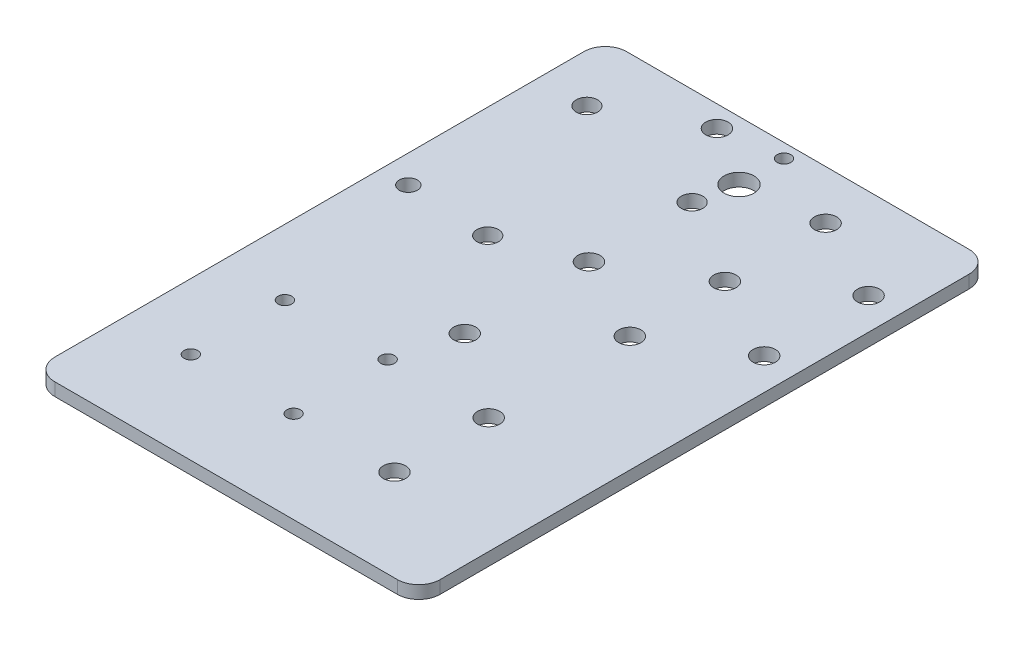
ISO-10303-21;
HEADER;
FILE_DESCRIPTION(('STEP AP214'),'2;1');
FILE_NAME('part.step','',(''),(''),'','','');
FILE_SCHEMA(('AUTOMOTIVE_DESIGN { 1 0 10303 214 1 1 1 1 }'));
ENDSEC;
DATA;
#1=APPLICATION_CONTEXT('core data for automotive mechanical design processes');
#2=APPLICATION_PROTOCOL_DEFINITION('international standard','automotive_design',2000,#1);
#3=PRODUCT_CONTEXT('',#1,'mechanical');
#4=PRODUCT('Part','Part','',(#3));
#5=PRODUCT_RELATED_PRODUCT_CATEGORY('part','',(#4));
#6=PRODUCT_DEFINITION_FORMATION('','',#4);
#7=PRODUCT_DEFINITION_CONTEXT('part definition',#1,'design');
#8=PRODUCT_DEFINITION('design','',#6,#7);
#9=PRODUCT_DEFINITION_SHAPE('','',#8);
#10=(LENGTH_UNIT() NAMED_UNIT(*) SI_UNIT(.MILLI.,.METRE.));
#11=(NAMED_UNIT(*) PLANE_ANGLE_UNIT() SI_UNIT($,.RADIAN.));
#12=(NAMED_UNIT(*) SI_UNIT($,.STERADIAN.) SOLID_ANGLE_UNIT());
#13=UNCERTAINTY_MEASURE_WITH_UNIT(LENGTH_MEASURE(1.E-05),#10,'distance_accuracy_value','');
#14=(GEOMETRIC_REPRESENTATION_CONTEXT(3) GLOBAL_UNCERTAINTY_ASSIGNED_CONTEXT((#13)) GLOBAL_UNIT_ASSIGNED_CONTEXT((#10,
#11,#12)) REPRESENTATION_CONTEXT('',''));
#15=CARTESIAN_POINT('',(0.,0.,0.));
#16=DIRECTION('',(0.,0.,1.));
#17=DIRECTION('',(1.,0.,0.));
#18=AXIS2_PLACEMENT_3D('',#15,#16,#17);
#19=CARTESIAN_POINT('',(0.,3.,0.));
#20=DIRECTION('',(0.,-1.,0.));
#21=DIRECTION('',(0.,0.,-1.));
#22=AXIS2_PLACEMENT_3D('',#19,#20,#21);
#23=PLANE('',#22);
#24=CARTESIAN_POINT('',(-3.55876124588053,3.,77.1695048170981));
#25=DIRECTION('',(0.,1.,0.));
#26=DIRECTION('',(0.,0.,1.));
#27=AXIS2_PLACEMENT_3D('',#24,#25,#26);
#28=CIRCLE('',#27,2.6);
#29=CARTESIAN_POINT('',(-3.55876124588053,3.,79.7695048170981));
#30=VERTEX_POINT('',#29);
#31=EDGE_CURVE('E533',#30,#30,#28,.T.);
#32=ORIENTED_EDGE('',*,*,#31,.F.);
#33=EDGE_LOOP('',(#32));
#34=FACE_BOUND('',#33,.T.);
#35=CARTESIAN_POINT('',(-23.3936515938965,3.,11.9198305394652));
#36=DIRECTION('',(0.,1.,0.));
#37=DIRECTION('',(0.,0.,1.));
#38=AXIS2_PLACEMENT_3D('',#35,#36,#37);
#39=CIRCLE('',#38,2.6);
#40=CARTESIAN_POINT('',(-23.3936515938965,3.,14.5198305394652));
#41=VERTEX_POINT('',#40);
#42=EDGE_CURVE('E535',#41,#41,#39,.T.);
#43=ORIENTED_EDGE('',*,*,#42,.F.);
#44=EDGE_LOOP('',(#43));
#45=FACE_BOUND('',#44,.T.);
#46=CARTESIAN_POINT('',(-27.1536514563145,3.,55.1695048170967));
#47=DIRECTION('',(0.,1.,0.));
#48=DIRECTION('',(0.,0.,1.));
#49=AXIS2_PLACEMENT_3D('',#46,#47,#48);
#50=CIRCLE('',#49,1.60000000000001);
#51=CARTESIAN_POINT('',(-27.1536514563145,3.,56.7695048170967));
#52=VERTEX_POINT('',#51);
#53=EDGE_CURVE('E540',#52,#52,#50,.T.);
#54=ORIENTED_EDGE('',*,*,#53,.F.);
#55=EDGE_LOOP('',(#54));
#56=FACE_BOUND('',#55,.T.);
#57=CARTESIAN_POINT('',(-23.3936515938965,3.,40.9198305394652));
#58=DIRECTION('',(0.,1.,0.));
#59=DIRECTION('',(0.,0.,1.));
#60=AXIS2_PLACEMENT_3D('',#57,#58,#59);
#61=CIRCLE('',#60,2.6);
#62=CARTESIAN_POINT('',(-23.3936515938965,3.,43.5198305394652));
#63=VERTEX_POINT('',#62);
#64=EDGE_CURVE('E543',#63,#63,#61,.T.);
#65=ORIENTED_EDGE('',*,*,#64,.F.);
#66=EDGE_LOOP('',(#65));
#67=FACE_BOUND('',#66,.T.);
#68=CARTESIAN_POINT('',(-3.55876124588053,3.,55.1695048170967));
#69=DIRECTION('',(0.,1.,0.));
#70=DIRECTION('',(0.,0.,1.));
#71=AXIS2_PLACEMENT_3D('',#68,#69,#70);
#72=CIRCLE('',#71,2.6);
#73=CARTESIAN_POINT('',(-3.55876124588053,3.,57.7695048170967));
#74=VERTEX_POINT('',#73);
#75=EDGE_CURVE('E534',#74,#74,#72,.T.);
#76=ORIENTED_EDGE('',*,*,#75,.F.);
#77=EDGE_LOOP('',(#76));
#78=FACE_BOUND('',#77,.T.);
#79=CARTESIAN_POINT('',(-27.1536514563145,3.,77.1337453453199));
#80=DIRECTION('',(0.,1.,0.));
#81=DIRECTION('',(0.,0.,1.));
#82=AXIS2_PLACEMENT_3D('',#79,#80,#81);
#83=CIRCLE('',#82,1.60000000000001);
#84=CARTESIAN_POINT('',(-27.1536514563145,3.,78.7337453453199));
#85=VERTEX_POINT('',#84);
#86=EDGE_CURVE('E538',#85,#85,#83,.T.);
#87=ORIENTED_EDGE('',*,*,#86,.F.);
#88=EDGE_LOOP('',(#87));
#89=FACE_BOUND('',#88,.T.);
#90=CARTESIAN_POINT('',(-3.55876124588053,3.,22.2023384186206));
#91=DIRECTION('',(0.,1.,0.));
#92=DIRECTION('',(0.,0.,1.));
#93=AXIS2_PLACEMENT_3D('',#90,#91,#92);
#94=CIRCLE('',#93,2.6);
#95=CARTESIAN_POINT('',(-3.55876124588053,3.,24.8023384186206));
#96=VERTEX_POINT('',#95);
#97=EDGE_CURVE('E549',#96,#96,#94,.T.);
#98=ORIENTED_EDGE('',*,*,#97,.F.);
#99=EDGE_LOOP('',(#98));
#100=FACE_BOUND('',#99,.T.);
#101=CARTESIAN_POINT('',(-3.55876124588053,3.,0.));
#102=DIRECTION('',(0.,1.,0.));
#103=DIRECTION('',(0.,0.,1.));
#104=AXIS2_PLACEMENT_3D('',#101,#102,#103);
#105=CIRCLE('',#104,2.6);
#106=CARTESIAN_POINT('',(-3.55876124588053,3.,2.6));
#107=VERTEX_POINT('',#106);
#108=EDGE_CURVE('E546',#107,#107,#105,.T.);
#109=ORIENTED_EDGE('',*,*,#108,.F.);
#110=EDGE_LOOP('',(#109));
#111=FACE_BOUND('',#110,.T.);
#112=CARTESIAN_POINT('',(-35.4136514732569,3.,-29.999999999606));
#113=DIRECTION('',(0.,1.,0.));
#114=DIRECTION('',(0.,0.,1.));
#115=AXIS2_PLACEMENT_3D('',#112,#113,#114);
#116=CIRCLE('',#115,2.6);
#117=CARTESIAN_POINT('',(-35.4136514732569,3.,-27.399999999606));
#118=VERTEX_POINT('',#117);
#119=EDGE_CURVE('E564',#118,#118,#116,.T.);
#120=ORIENTED_EDGE('',*,*,#119,.F.);
#121=EDGE_LOOP('',(#120));
#122=FACE_BOUND('',#121,.T.);
#123=CARTESIAN_POINT('',(16.0863486114441,3.,-13.9084589783953));
#124=DIRECTION('',(0.,1.,0.));
#125=DIRECTION('',(0.,0.,1.));
#126=AXIS2_PLACEMENT_3D('',#123,#124,#125);
#127=CIRCLE('',#126,2.6);
#128=CARTESIAN_POINT('',(16.0863486114441,3.,-11.3084589783953));
#129=VERTEX_POINT('',#128);
#130=EDGE_CURVE('E568',#129,#129,#127,.T.);
#131=ORIENTED_EDGE('',*,*,#130,.F.);
#132=EDGE_LOOP('',(#131));
#133=FACE_BOUND('',#132,.T.);
#134=CARTESIAN_POINT('',(-51.1536514563172,3.,55.1695048170967));
#135=DIRECTION('',(0.,1.,0.));
#136=DIRECTION('',(0.,0.,1.));
#137=AXIS2_PLACEMENT_3D('',#134,#135,#136);
#138=CIRCLE('',#137,1.60000000000001);
#139=CARTESIAN_POINT('',(-51.1536514563172,3.,56.7695048170967));
#140=VERTEX_POINT('',#139);
#141=EDGE_CURVE('E572',#140,#140,#138,.T.);
#142=ORIENTED_EDGE('',*,*,#141,.F.);
#143=EDGE_LOOP('',(#142));
#144=FACE_BOUND('',#143,.T.);
#145=CARTESIAN_POINT('',(16.0863486114963,3.,10.4651659730914));
#146=DIRECTION('',(0.,1.,0.));
#147=DIRECTION('',(0.,0.,1.));
#148=AXIS2_PLACEMENT_3D('',#145,#146,#147);
#149=CIRCLE('',#148,2.6);
#150=CARTESIAN_POINT('',(16.0863486114963,3.,13.0651659730914));
#151=VERTEX_POINT('',#150);
#152=EDGE_CURVE('E576',#151,#151,#149,.T.);
#153=ORIENTED_EDGE('',*,*,#152,.F.);
#154=EDGE_LOOP('',(#153));
#155=FACE_BOUND('',#154,.T.);
#156=CARTESIAN_POINT('',(-51.1536514563172,3.,77.1337453453187));
#157=DIRECTION('',(0.,1.,0.));
#158=DIRECTION('',(0.,0.,1.));
#159=AXIS2_PLACEMENT_3D('',#156,#157,#158);
#160=CIRCLE('',#159,1.6);
#161=CARTESIAN_POINT('',(-51.1536514563172,3.,78.7337453453187));
#162=VERTEX_POINT('',#161);
#163=EDGE_CURVE('E580',#162,#162,#160,.T.);
#164=ORIENTED_EDGE('',*,*,#163,.F.);
#165=EDGE_LOOP('',(#164));
#166=FACE_BOUND('',#165,.T.);
#167=CARTESIAN_POINT('',(-3.55876124588053,3.,-23.5187939569107));
#168=DIRECTION('',(0.,1.,0.));
#169=DIRECTION('',(0.,0.,1.));
#170=AXIS2_PLACEMENT_3D('',#167,#168,#169);
#171=CIRCLE('',#170,2.6);
#172=CARTESIAN_POINT('',(-3.55876124588053,3.,-20.9187939569107));
#173=VERTEX_POINT('',#172);
#174=EDGE_CURVE('E170',#173,#173,#171,.T.);
#175=ORIENTED_EDGE('',*,*,#174,.F.);
#176=EDGE_LOOP('',(#175));
#177=FACE_BOUND('',#176,.T.);
#178=DIRECTION('',(1.,0.,0.));
#179=VECTOR('',#178,1.);
#180=CARTESIAN_POINT('',(28.0292434658726,3.,98.5582878352751));
#181=LINE('',#180,#179);
#182=CARTESIAN_POINT('',(-61.5,3.,98.5582878352751));
#183=VERTEX_POINT('',#182);
#184=CARTESIAN_POINT('',(18.5,3.,98.5582878352751));
#185=VERTEX_POINT('',#184);
#186=EDGE_CURVE('E207',#183,#185,#181,.T.);
#187=ORIENTED_EDGE('',*,*,#186,.T.);
#188=CARTESIAN_POINT('',(18.5,3.,93.5582878352751));
#189=DIRECTION('',(0.,-1.,0.));
#190=DIRECTION('',(0.,0.,-1.));
#191=AXIS2_PLACEMENT_3D('',#188,#189,#190);
#192=CIRCLE('',#191,5.);
#193=CARTESIAN_POINT('',(23.5,3.,93.5582878352751));
#194=VERTEX_POINT('',#193);
#195=EDGE_CURVE('E161',#185,#194,#192,.F.);
#196=ORIENTED_EDGE('',*,*,#195,.T.);
#197=DIRECTION('',(0.,0.,-1.));
#198=VECTOR('',#197,1.);
#199=CARTESIAN_POINT('',(23.5,3.,-35.));
#200=LINE('',#199,#198);
#201=CARTESIAN_POINT('',(23.5,3.,-30.));
#202=VERTEX_POINT('',#201);
#203=EDGE_CURVE('E224',#194,#202,#200,.T.);
#204=ORIENTED_EDGE('',*,*,#203,.T.);
#205=CARTESIAN_POINT('',(18.5,3.,-30.));
#206=DIRECTION('',(0.,-1.,0.));
#207=DIRECTION('',(0.,0.,-1.));
#208=AXIS2_PLACEMENT_3D('',#205,#206,#207);
#209=CIRCLE('',#208,5.);
#210=CARTESIAN_POINT('',(18.5,3.,-35.));
#211=VERTEX_POINT('',#210);
#212=EDGE_CURVE('E138',#202,#211,#209,.F.);
#213=ORIENTED_EDGE('',*,*,#212,.T.);
#214=DIRECTION('',(-1.,0.,0.));
#215=VECTOR('',#214,1.);
#216=CARTESIAN_POINT('',(-17.5,3.,-35.));
#217=LINE('',#216,#215);
#218=CARTESIAN_POINT('',(-61.5,3.,-35.));
#219=VERTEX_POINT('',#218);
#220=EDGE_CURVE('E117',#211,#219,#217,.T.);
#221=ORIENTED_EDGE('',*,*,#220,.T.);
#222=CARTESIAN_POINT('',(-61.5,3.,-30.));
#223=DIRECTION('',(0.,-1.,0.));
#224=DIRECTION('',(0.,0.,-1.));
#225=AXIS2_PLACEMENT_3D('',#222,#223,#224);
#226=CIRCLE('',#225,5.);
#227=CARTESIAN_POINT('',(-66.5,3.,-30.));
#228=VERTEX_POINT('',#227);
#229=EDGE_CURVE('E126',#219,#228,#226,.F.);
#230=ORIENTED_EDGE('',*,*,#229,.T.);
#231=DIRECTION('',(0.,0.,1.));
#232=VECTOR('',#231,1.);
#233=CARTESIAN_POINT('',(-66.5,3.,35.));
#234=LINE('',#233,#232);
#235=CARTESIAN_POINT('',(-66.5,3.,93.5582878352751));
#236=VERTEX_POINT('',#235);
#237=EDGE_CURVE('E148',#228,#236,#234,.T.);
#238=ORIENTED_EDGE('',*,*,#237,.T.);
#239=CARTESIAN_POINT('',(-61.5,3.,93.5582878352751));
#240=DIRECTION('',(0.,-1.,0.));
#241=DIRECTION('',(0.,0.,-1.));
#242=AXIS2_PLACEMENT_3D('',#239,#240,#241);
#243=CIRCLE('',#242,5.);
#244=EDGE_CURVE('E159',#236,#183,#243,.F.);
#245=ORIENTED_EDGE('',*,*,#244,.T.);
#246=EDGE_LOOP('',(#187,#196,#204,#213,#221,#230,#238,#245));
#247=FACE_BOUND('',#246,.T.);
#248=CARTESIAN_POINT('',(-55.1536514732389,3.,-19.3704112343334));
#249=DIRECTION('',(0.,1.,0.));
#250=DIRECTION('',(0.,0.,1.));
#251=AXIS2_PLACEMENT_3D('',#248,#249,#250);
#252=CIRCLE('',#251,2.5);
#253=CARTESIAN_POINT('',(-55.1536514732389,3.,-16.8704112343334));
#254=VERTEX_POINT('',#253);
#255=EDGE_CURVE('E216',#254,#254,#252,.T.);
#256=ORIENTED_EDGE('',*,*,#255,.F.);
#257=EDGE_LOOP('',(#256));
#258=FACE_BOUND('',#257,.T.);
#259=CARTESIAN_POINT('',(-40.5000000000019,3.,18.4480525361976));
#260=DIRECTION('',(0.,1.,0.));
#261=DIRECTION('',(0.,0.,1.));
#262=AXIS2_PLACEMENT_3D('',#259,#260,#261);
#263=CIRCLE('',#262,2.50000000000006);
#264=CARTESIAN_POINT('',(-40.5000000000019,3.,20.9480525361977));
#265=VERTEX_POINT('',#264);
#266=EDGE_CURVE('E229',#265,#265,#263,.T.);
#267=ORIENTED_EDGE('',*,*,#266,.F.);
#268=EDGE_LOOP('',(#267));
#269=FACE_BOUND('',#268,.T.);
#270=CARTESIAN_POINT('',(-23.3936513922616,3.,-12.1664979508307));
#271=DIRECTION('',(0.,1.,0.));
#272=DIRECTION('',(0.,0.,1.));
#273=AXIS2_PLACEMENT_3D('',#270,#271,#272);
#274=CIRCLE('',#273,2.5);
#275=CARTESIAN_POINT('',(-23.3936513922616,3.,-9.6664979508307));
#276=VERTEX_POINT('',#275);
#277=EDGE_CURVE('E234',#276,#276,#274,.T.);
#278=ORIENTED_EDGE('',*,*,#277,.F.);
#279=EDGE_LOOP('',(#278));
#280=FACE_BOUND('',#279,.T.);
#281=CARTESIAN_POINT('',(-21.5000000000002,3.,-31.75));
#282=DIRECTION('',(0.,-1.,0.));
#283=DIRECTION('',(0.,0.,1.));
#284=AXIS2_PLACEMENT_3D('',#281,#282,#283);
#285=CIRCLE('',#284,1.6);
#286=CARTESIAN_POINT('',(-21.5000000000002,3.,-30.15));
#287=VERTEX_POINT('',#286);
#288=EDGE_CURVE('E249',#287,#287,#285,.T.);
#289=ORIENTED_EDGE('',*,*,#288,.T.);
#290=EDGE_LOOP('',(#289));
#291=FACE_BOUND('',#290,.T.);
#292=CARTESIAN_POINT('',(-21.5000000000002,3.,-21.25));
#293=DIRECTION('',(0.,-1.,0.));
#294=DIRECTION('',(0.,0.,1.));
#295=AXIS2_PLACEMENT_3D('',#292,#293,#294);
#296=CIRCLE('',#295,3.5);
#297=CARTESIAN_POINT('',(-21.5000000000002,3.,-17.75));
#298=VERTEX_POINT('',#297);
#299=EDGE_CURVE('E243',#298,#298,#296,.T.);
#300=ORIENTED_EDGE('',*,*,#299,.T.);
#301=EDGE_LOOP('',(#300));
#302=FACE_BOUND('',#301,.T.);
#303=CARTESIAN_POINT('',(-60.,3.,17.5000000000001));
#304=DIRECTION('',(0.,1.,0.));
#305=DIRECTION('',(0.,0.,-1.));
#306=AXIS2_PLACEMENT_3D('',#303,#304,#305);
#307=CIRCLE('',#306,2.1);
#308=CARTESIAN_POINT('',(-60.,3.,15.4000000000001));
#309=VERTEX_POINT('',#308);
#310=EDGE_CURVE('E252',#309,#309,#307,.T.);
#311=ORIENTED_EDGE('',*,*,#310,.F.);
#312=EDGE_LOOP('',(#311));
#313=FACE_BOUND('',#312,.T.);
#314=ADVANCED_FACE('F37',(#34,#45,#56,#67,#78,#89,#100,#111,#122,#133,#144,#155,#166,#177,#247,
#258,#269,#280,#291,#302,#313),#23,.F.);
#315=CARTESIAN_POINT('',(0.,0.,0.));
#316=DIRECTION('',(0.,-1.,0.));
#317=DIRECTION('',(0.,0.,-1.));
#318=AXIS2_PLACEMENT_3D('',#315,#316,#317);
#319=PLANE('',#318);
#320=CARTESIAN_POINT('',(-3.55876124588053,0.,77.1695048170981));
#321=DIRECTION('',(0.,-1.,0.));
#322=DIRECTION('',(0.,0.,-1.));
#323=AXIS2_PLACEMENT_3D('',#320,#321,#322);
#324=CIRCLE('',#323,2.6);
#325=CARTESIAN_POINT('',(-3.55876124588053,0.,74.5695048170981));
#326=VERTEX_POINT('',#325);
#327=EDGE_CURVE('E41',#326,#326,#324,.T.);
#328=ORIENTED_EDGE('',*,*,#327,.F.);
#329=EDGE_LOOP('',(#328));
#330=FACE_BOUND('',#329,.T.);
#331=CARTESIAN_POINT('',(-23.3936515938965,0.,11.9198305394652));
#332=DIRECTION('',(0.,-1.,0.));
#333=DIRECTION('',(0.,0.,-1.));
#334=AXIS2_PLACEMENT_3D('',#331,#332,#333);
#335=CIRCLE('',#334,2.6);
#336=CARTESIAN_POINT('',(-23.3936515938965,0.,9.31983053946522));
#337=VERTEX_POINT('',#336);
#338=EDGE_CURVE('E202',#337,#337,#335,.T.);
#339=ORIENTED_EDGE('',*,*,#338,.F.);
#340=EDGE_LOOP('',(#339));
#341=FACE_BOUND('',#340,.T.);
#342=CARTESIAN_POINT('',(-27.1536514563145,0.,55.1695048170967));
#343=DIRECTION('',(0.,-1.,0.));
#344=DIRECTION('',(0.,0.,-1.));
#345=AXIS2_PLACEMENT_3D('',#342,#343,#344);
#346=CIRCLE('',#345,1.60000000000001);
#347=CARTESIAN_POINT('',(-27.1536514563145,0.,53.5695048170967));
#348=VERTEX_POINT('',#347);
#349=EDGE_CURVE('E200',#348,#348,#346,.T.);
#350=ORIENTED_EDGE('',*,*,#349,.F.);
#351=EDGE_LOOP('',(#350));
#352=FACE_BOUND('',#351,.T.);
#353=CARTESIAN_POINT('',(-23.3936515938965,0.,40.9198305394652));
#354=DIRECTION('',(0.,-1.,0.));
#355=DIRECTION('',(0.,0.,-1.));
#356=AXIS2_PLACEMENT_3D('',#353,#354,#355);
#357=CIRCLE('',#356,2.6);
#358=CARTESIAN_POINT('',(-23.3936515938965,0.,38.3198305394652));
#359=VERTEX_POINT('',#358);
#360=EDGE_CURVE('E197',#359,#359,#357,.T.);
#361=ORIENTED_EDGE('',*,*,#360,.F.);
#362=EDGE_LOOP('',(#361));
#363=FACE_BOUND('',#362,.T.);
#364=CARTESIAN_POINT('',(-3.55876124588053,0.,55.1695048170967));
#365=DIRECTION('',(0.,-1.,0.));
#366=DIRECTION('',(0.,0.,-1.));
#367=AXIS2_PLACEMENT_3D('',#364,#365,#366);
#368=CIRCLE('',#367,2.6);
#369=CARTESIAN_POINT('',(-3.55876124588053,0.,52.5695048170967));
#370=VERTEX_POINT('',#369);
#371=EDGE_CURVE('E194',#370,#370,#368,.T.);
#372=ORIENTED_EDGE('',*,*,#371,.F.);
#373=EDGE_LOOP('',(#372));
#374=FACE_BOUND('',#373,.T.);
#375=CARTESIAN_POINT('',(-27.1536514563145,0.,77.1337453453199));
#376=DIRECTION('',(0.,-1.,0.));
#377=DIRECTION('',(0.,0.,-1.));
#378=AXIS2_PLACEMENT_3D('',#375,#376,#377);
#379=CIRCLE('',#378,1.60000000000001);
#380=CARTESIAN_POINT('',(-27.1536514563145,0.,75.5337453453199));
#381=VERTEX_POINT('',#380);
#382=EDGE_CURVE('E191',#381,#381,#379,.T.);
#383=ORIENTED_EDGE('',*,*,#382,.F.);
#384=EDGE_LOOP('',(#383));
#385=FACE_BOUND('',#384,.T.);
#386=CARTESIAN_POINT('',(-3.55876124588053,0.,22.2023384186206));
#387=DIRECTION('',(0.,-1.,0.));
#388=DIRECTION('',(0.,0.,-1.));
#389=AXIS2_PLACEMENT_3D('',#386,#387,#388);
#390=CIRCLE('',#389,2.6);
#391=CARTESIAN_POINT('',(-3.55876124588053,0.,19.6023384186206));
#392=VERTEX_POINT('',#391);
#393=EDGE_CURVE('E188',#392,#392,#390,.T.);
#394=ORIENTED_EDGE('',*,*,#393,.F.);
#395=EDGE_LOOP('',(#394));
#396=FACE_BOUND('',#395,.T.);
#397=CARTESIAN_POINT('',(-3.55876124588053,0.,0.));
#398=DIRECTION('',(0.,-1.,0.));
#399=DIRECTION('',(0.,0.,-1.));
#400=AXIS2_PLACEMENT_3D('',#397,#398,#399);
#401=CIRCLE('',#400,2.6);
#402=CARTESIAN_POINT('',(-3.55876124588053,0.,-2.6));
#403=VERTEX_POINT('',#402);
#404=EDGE_CURVE('E185',#403,#403,#401,.T.);
#405=ORIENTED_EDGE('',*,*,#404,.F.);
#406=EDGE_LOOP('',(#405));
#407=FACE_BOUND('',#406,.T.);
#408=CARTESIAN_POINT('',(-35.4136514732569,0.,-29.999999999606));
#409=DIRECTION('',(0.,-1.,0.));
#410=DIRECTION('',(0.,0.,-1.));
#411=AXIS2_PLACEMENT_3D('',#408,#409,#410);
#412=CIRCLE('',#411,2.6);
#413=CARTESIAN_POINT('',(-35.4136514732569,0.,-32.599999999606));
#414=VERTEX_POINT('',#413);
#415=EDGE_CURVE('E182',#414,#414,#412,.T.);
#416=ORIENTED_EDGE('',*,*,#415,.F.);
#417=EDGE_LOOP('',(#416));
#418=FACE_BOUND('',#417,.T.);
#419=CARTESIAN_POINT('',(16.0863486114441,0.,-13.9084589783953));
#420=DIRECTION('',(0.,-1.,0.));
#421=DIRECTION('',(0.,0.,-1.));
#422=AXIS2_PLACEMENT_3D('',#419,#420,#421);
#423=CIRCLE('',#422,2.6);
#424=CARTESIAN_POINT('',(16.0863486114441,0.,-16.5084589783953));
#425=VERTEX_POINT('',#424);
#426=EDGE_CURVE('E179',#425,#425,#423,.T.);
#427=ORIENTED_EDGE('',*,*,#426,.F.);
#428=EDGE_LOOP('',(#427));
#429=FACE_BOUND('',#428,.T.);
#430=CARTESIAN_POINT('',(-51.1536514563172,0.,55.1695048170967));
#431=DIRECTION('',(0.,-1.,0.));
#432=DIRECTION('',(0.,0.,-1.));
#433=AXIS2_PLACEMENT_3D('',#430,#431,#432);
#434=CIRCLE('',#433,1.60000000000001);
#435=CARTESIAN_POINT('',(-51.1536514563172,0.,53.5695048170967));
#436=VERTEX_POINT('',#435);
#437=EDGE_CURVE('E176',#436,#436,#434,.T.);
#438=ORIENTED_EDGE('',*,*,#437,.F.);
#439=EDGE_LOOP('',(#438));
#440=FACE_BOUND('',#439,.T.);
#441=CARTESIAN_POINT('',(16.0863486114963,0.,10.4651659730914));
#442=DIRECTION('',(0.,-1.,0.));
#443=DIRECTION('',(0.,0.,-1.));
#444=AXIS2_PLACEMENT_3D('',#441,#442,#443);
#445=CIRCLE('',#444,2.6);
#446=CARTESIAN_POINT('',(16.0863486114963,0.,7.86516597309144));
#447=VERTEX_POINT('',#446);
#448=EDGE_CURVE('E173',#447,#447,#445,.T.);
#449=ORIENTED_EDGE('',*,*,#448,.F.);
#450=EDGE_LOOP('',(#449));
#451=FACE_BOUND('',#450,.T.);
#452=CARTESIAN_POINT('',(-51.1536514563172,0.,77.1337453453187));
#453=DIRECTION('',(0.,-1.,0.));
#454=DIRECTION('',(0.,0.,-1.));
#455=AXIS2_PLACEMENT_3D('',#452,#453,#454);
#456=CIRCLE('',#455,1.6);
#457=CARTESIAN_POINT('',(-51.1536514563172,0.,75.5337453453187));
#458=VERTEX_POINT('',#457);
#459=EDGE_CURVE('E169',#458,#458,#456,.T.);
#460=ORIENTED_EDGE('',*,*,#459,.F.);
#461=EDGE_LOOP('',(#460));
#462=FACE_BOUND('',#461,.T.);
#463=CARTESIAN_POINT('',(-3.55876124588053,0.,-23.5187939569107));
#464=DIRECTION('',(0.,-1.,0.));
#465=DIRECTION('',(0.,0.,-1.));
#466=AXIS2_PLACEMENT_3D('',#463,#464,#465);
#467=CIRCLE('',#466,2.6);
#468=CARTESIAN_POINT('',(-3.55876124588053,0.,-26.1187939569107));
#469=VERTEX_POINT('',#468);
#470=EDGE_CURVE('E166',#469,#469,#467,.T.);
#471=ORIENTED_EDGE('',*,*,#470,.F.);
#472=EDGE_LOOP('',(#471));
#473=FACE_BOUND('',#472,.T.);
#474=DIRECTION('',(0.,0.,-1.));
#475=VECTOR('',#474,1.);
#476=CARTESIAN_POINT('',(23.5,0.,-35.));
#477=LINE('',#476,#475);
#478=CARTESIAN_POINT('',(23.5,0.,93.5582878352751));
#479=VERTEX_POINT('',#478);
#480=CARTESIAN_POINT('',(23.5,0.,-30.));
#481=VERTEX_POINT('',#480);
#482=EDGE_CURVE('E227',#479,#481,#477,.T.);
#483=ORIENTED_EDGE('',*,*,#482,.F.);
#484=CARTESIAN_POINT('',(18.5,0.,93.5582878352751));
#485=DIRECTION('',(0.,-1.,0.));
#486=DIRECTION('',(0.,0.,-1.));
#487=AXIS2_PLACEMENT_3D('',#484,#485,#486);
#488=CIRCLE('',#487,5.);
#489=CARTESIAN_POINT('',(18.5,0.,98.5582878352751));
#490=VERTEX_POINT('',#489);
#491=EDGE_CURVE('E46',#479,#490,#488,.T.);
#492=ORIENTED_EDGE('',*,*,#491,.T.);
#493=DIRECTION('',(1.,0.,0.));
#494=VECTOR('',#493,1.);
#495=CARTESIAN_POINT('',(28.0292434658726,0.,98.5582878352751));
#496=LINE('',#495,#494);
#497=CARTESIAN_POINT('',(-61.5,0.,98.5582878352751));
#498=VERTEX_POINT('',#497);
#499=EDGE_CURVE('E211',#498,#490,#496,.T.);
#500=ORIENTED_EDGE('',*,*,#499,.F.);
#501=CARTESIAN_POINT('',(-61.5,0.,93.5582878352751));
#502=DIRECTION('',(0.,-1.,0.));
#503=DIRECTION('',(0.,0.,-1.));
#504=AXIS2_PLACEMENT_3D('',#501,#502,#503);
#505=CIRCLE('',#504,5.);
#506=CARTESIAN_POINT('',(-66.5,0.,93.5582878352751));
#507=VERTEX_POINT('',#506);
#508=EDGE_CURVE('E54',#498,#507,#505,.T.);
#509=ORIENTED_EDGE('',*,*,#508,.T.);
#510=DIRECTION('',(0.,0.,1.));
#511=VECTOR('',#510,1.);
#512=CARTESIAN_POINT('',(-66.5,0.,35.));
#513=LINE('',#512,#511);
#514=CARTESIAN_POINT('',(-66.5,0.,-30.));
#515=VERTEX_POINT('',#514);
#516=EDGE_CURVE('E118',#515,#507,#513,.T.);
#517=ORIENTED_EDGE('',*,*,#516,.F.);
#518=CARTESIAN_POINT('',(-61.5,0.,-30.));
#519=DIRECTION('',(0.,-1.,0.));
#520=DIRECTION('',(0.,0.,-1.));
#521=AXIS2_PLACEMENT_3D('',#518,#519,#520);
#522=CIRCLE('',#521,5.);
#523=CARTESIAN_POINT('',(-61.5,0.,-35.));
#524=VERTEX_POINT('',#523);
#525=EDGE_CURVE('E121',#515,#524,#522,.T.);
#526=ORIENTED_EDGE('',*,*,#525,.T.);
#527=DIRECTION('',(-1.,0.,0.));
#528=VECTOR('',#527,1.);
#529=CARTESIAN_POINT('',(-17.5,0.,-35.));
#530=LINE('',#529,#528);
#531=CARTESIAN_POINT('',(18.5,0.,-35.));
#532=VERTEX_POINT('',#531);
#533=EDGE_CURVE('E107',#532,#524,#530,.T.);
#534=ORIENTED_EDGE('',*,*,#533,.F.);
#535=CARTESIAN_POINT('',(18.5,0.,-30.));
#536=DIRECTION('',(0.,-1.,0.));
#537=DIRECTION('',(0.,0.,-1.));
#538=AXIS2_PLACEMENT_3D('',#535,#536,#537);
#539=CIRCLE('',#538,5.);
#540=EDGE_CURVE('E143',#532,#481,#539,.T.);
#541=ORIENTED_EDGE('',*,*,#540,.T.);
#542=EDGE_LOOP('',(#483,#492,#500,#509,#517,#526,#534,#541));
#543=FACE_BOUND('',#542,.T.);
#544=CARTESIAN_POINT('',(-55.1536514732389,0.,-19.3704112343334));
#545=DIRECTION('',(0.,1.,0.));
#546=DIRECTION('',(0.,0.,1.));
#547=AXIS2_PLACEMENT_3D('',#544,#545,#546);
#548=CIRCLE('',#547,2.5);
#549=CARTESIAN_POINT('',(-55.1536514732389,0.,-16.8704112343334));
#550=VERTEX_POINT('',#549);
#551=EDGE_CURVE('E221',#550,#550,#548,.T.);
#552=ORIENTED_EDGE('',*,*,#551,.T.);
#553=EDGE_LOOP('',(#552));
#554=FACE_BOUND('',#553,.T.);
#555=CARTESIAN_POINT('',(-40.5000000000019,0.,18.4480525361976));
#556=DIRECTION('',(0.,1.,0.));
#557=DIRECTION('',(0.,0.,1.));
#558=AXIS2_PLACEMENT_3D('',#555,#556,#557);
#559=CIRCLE('',#558,2.50000000000006);
#560=CARTESIAN_POINT('',(-40.5000000000019,0.,20.9480525361977));
#561=VERTEX_POINT('',#560);
#562=EDGE_CURVE('E231',#561,#561,#559,.T.);
#563=ORIENTED_EDGE('',*,*,#562,.T.);
#564=EDGE_LOOP('',(#563));
#565=FACE_BOUND('',#564,.T.);
#566=CARTESIAN_POINT('',(-23.3936513922616,0.,-12.1664979508307));
#567=DIRECTION('',(0.,1.,0.));
#568=DIRECTION('',(0.,0.,1.));
#569=AXIS2_PLACEMENT_3D('',#566,#567,#568);
#570=CIRCLE('',#569,2.5);
#571=CARTESIAN_POINT('',(-23.3936513922616,0.,-9.6664979508307));
#572=VERTEX_POINT('',#571);
#573=EDGE_CURVE('E237',#572,#572,#570,.T.);
#574=ORIENTED_EDGE('',*,*,#573,.T.);
#575=EDGE_LOOP('',(#574));
#576=FACE_BOUND('',#575,.T.);
#577=CARTESIAN_POINT('',(-21.5000000000002,0.,-31.75));
#578=DIRECTION('',(0.,-1.,0.));
#579=DIRECTION('',(0.,0.,1.));
#580=AXIS2_PLACEMENT_3D('',#577,#578,#579);
#581=CIRCLE('',#580,1.6);
#582=CARTESIAN_POINT('',(-21.5000000000002,0.,-30.15));
#583=VERTEX_POINT('',#582);
#584=EDGE_CURVE('E246',#583,#583,#581,.T.);
#585=ORIENTED_EDGE('',*,*,#584,.F.);
#586=EDGE_LOOP('',(#585));
#587=FACE_BOUND('',#586,.T.);
#588=CARTESIAN_POINT('',(-21.5000000000002,0.,-21.25));
#589=DIRECTION('',(0.,-1.,0.));
#590=DIRECTION('',(0.,0.,1.));
#591=AXIS2_PLACEMENT_3D('',#588,#589,#590);
#592=CIRCLE('',#591,3.5);
#593=CARTESIAN_POINT('',(-21.5000000000002,0.,-17.75));
#594=VERTEX_POINT('',#593);
#595=EDGE_CURVE('E240',#594,#594,#592,.T.);
#596=ORIENTED_EDGE('',*,*,#595,.F.);
#597=EDGE_LOOP('',(#596));
#598=FACE_BOUND('',#597,.T.);
#599=CARTESIAN_POINT('',(-60.,0.,17.5000000000001));
#600=DIRECTION('',(0.,-1.,0.));
#601=DIRECTION('',(0.,0.,-1.));
#602=AXIS2_PLACEMENT_3D('',#599,#600,#601);
#603=CIRCLE('',#602,2.1);
#604=CARTESIAN_POINT('',(-60.,0.,15.4000000000001));
#605=VERTEX_POINT('',#604);
#606=EDGE_CURVE('E133',#605,#605,#603,.T.);
#607=ORIENTED_EDGE('',*,*,#606,.F.);
#608=EDGE_LOOP('',(#607));
#609=FACE_BOUND('',#608,.T.);
#610=ADVANCED_FACE('F122',(#330,#341,#352,#363,#374,#385,#396,#407,#418,#429,#440,#451,#462,
#473,#543,#554,#565,#576,#587,#598,#609),#319,.T.);
#611=CARTESIAN_POINT('',(-17.5,3.,-35.));
#612=DIRECTION('',(0.,0.,1.));
#613=DIRECTION('',(1.,0.,0.));
#614=AXIS2_PLACEMENT_3D('',#611,#612,#613);
#615=PLANE('',#614);
#616=ORIENTED_EDGE('',*,*,#220,.F.);
#617=DIRECTION('',(0.,1.,0.));
#618=VECTOR('',#617,1.);
#619=CARTESIAN_POINT('',(18.5,0.,-35.));
#620=LINE('',#619,#618);
#621=EDGE_CURVE('E114',#211,#532,#620,.F.);
#622=ORIENTED_EDGE('',*,*,#621,.T.);
#623=ORIENTED_EDGE('',*,*,#533,.T.);
#624=DIRECTION('',(0.,1.,0.));
#625=VECTOR('',#624,1.);
#626=CARTESIAN_POINT('',(-61.5,3.,-35.));
#627=LINE('',#626,#625);
#628=EDGE_CURVE('E112',#524,#219,#627,.T.);
#629=ORIENTED_EDGE('',*,*,#628,.T.);
#630=EDGE_LOOP('',(#616,#622,#623,#629));
#631=FACE_BOUND('',#630,.T.);
#632=ADVANCED_FACE('F110',(#631),#615,.F.);
#633=CARTESIAN_POINT('',(-66.5,0.,35.));
#634=DIRECTION('',(-1.,0.,0.));
#635=DIRECTION('',(0.,0.,1.));
#636=AXIS2_PLACEMENT_3D('',#633,#634,#635);
#637=PLANE('',#636);
#638=ORIENTED_EDGE('',*,*,#516,.T.);
#639=DIRECTION('',(0.,1.,0.));
#640=VECTOR('',#639,1.);
#641=CARTESIAN_POINT('',(-66.5,0.,93.5582878352751));
#642=LINE('',#641,#640);
#643=EDGE_CURVE('E11',#507,#236,#642,.T.);
#644=ORIENTED_EDGE('',*,*,#643,.T.);
#645=ORIENTED_EDGE('',*,*,#237,.F.);
#646=DIRECTION('',(0.,1.,0.));
#647=VECTOR('',#646,1.);
#648=CARTESIAN_POINT('',(-66.5,0.,-30.));
#649=LINE('',#648,#647);
#650=EDGE_CURVE('E136',#228,#515,#649,.F.);
#651=ORIENTED_EDGE('',*,*,#650,.T.);
#652=EDGE_LOOP('',(#638,#644,#645,#651));
#653=FACE_BOUND('',#652,.T.);
#654=ADVANCED_FACE('F270',(#653),#637,.T.);
#655=CARTESIAN_POINT('',(-60.,-7.,17.5000000000001));
#656=DIRECTION('',(0.,1.,0.));
#657=DIRECTION('',(0.,0.,1.));
#658=AXIS2_PLACEMENT_3D('',#655,#656,#657);
#659=CYLINDRICAL_SURFACE('',#658,2.1);
#660=ORIENTED_EDGE('',*,*,#606,.T.);
#661=EDGE_LOOP('',(#660));
#662=FACE_BOUND('',#661,.T.);
#663=ORIENTED_EDGE('',*,*,#310,.T.);
#664=EDGE_LOOP('',(#663));
#665=FACE_BOUND('',#664,.T.);
#666=ADVANCED_FACE('F261',(#662,#665),#659,.F.);
#667=CARTESIAN_POINT('',(-21.5000000000002,3.,-21.25));
#668=DIRECTION('',(0.,-1.,0.));
#669=DIRECTION('',(0.,0.,-1.));
#670=AXIS2_PLACEMENT_3D('',#667,#668,#669);
#671=CYLINDRICAL_SURFACE('',#670,3.5);
#672=ORIENTED_EDGE('',*,*,#299,.F.);
#673=EDGE_LOOP('',(#672));
#674=FACE_BOUND('',#673,.T.);
#675=ORIENTED_EDGE('',*,*,#595,.T.);
#676=EDGE_LOOP('',(#675));
#677=FACE_BOUND('',#676,.T.);
#678=ADVANCED_FACE('F321',(#674,#677),#671,.F.);
#679=CARTESIAN_POINT('',(-21.5000000000002,3.,-31.75));
#680=DIRECTION('',(0.,-1.,0.));
#681=DIRECTION('',(0.,0.,-1.));
#682=AXIS2_PLACEMENT_3D('',#679,#680,#681);
#683=CYLINDRICAL_SURFACE('',#682,1.6);
#684=ORIENTED_EDGE('',*,*,#288,.F.);
#685=EDGE_LOOP('',(#684));
#686=FACE_BOUND('',#685,.T.);
#687=ORIENTED_EDGE('',*,*,#584,.T.);
#688=EDGE_LOOP('',(#687));
#689=FACE_BOUND('',#688,.T.);
#690=ADVANCED_FACE('F280',(#686,#689),#683,.F.);
#691=CARTESIAN_POINT('',(-61.5,3.,-30.));
#692=DIRECTION('',(0.,-1.,0.));
#693=DIRECTION('',(0.,0.,-1.));
#694=AXIS2_PLACEMENT_3D('',#691,#692,#693);
#695=CYLINDRICAL_SURFACE('',#694,5.);
#696=ORIENTED_EDGE('',*,*,#525,.F.);
#697=ORIENTED_EDGE('',*,*,#650,.F.);
#698=ORIENTED_EDGE('',*,*,#229,.F.);
#699=ORIENTED_EDGE('',*,*,#628,.F.);
#700=EDGE_LOOP('',(#696,#697,#698,#699));
#701=FACE_BOUND('',#700,.T.);
#702=ADVANCED_FACE('F129',(#701),#695,.T.);
#703=CARTESIAN_POINT('',(-23.3936513922616,0.,-12.1664979508307));
#704=DIRECTION('',(0.,1.,0.));
#705=DIRECTION('',(0.,0.,1.));
#706=AXIS2_PLACEMENT_3D('',#703,#704,#705);
#707=CYLINDRICAL_SURFACE('',#706,2.5);
#708=ORIENTED_EDGE('',*,*,#573,.F.);
#709=EDGE_LOOP('',(#708));
#710=FACE_BOUND('',#709,.T.);
#711=ORIENTED_EDGE('',*,*,#277,.T.);
#712=EDGE_LOOP('',(#711));
#713=FACE_BOUND('',#712,.T.);
#714=ADVANCED_FACE('F279',(#710,#713),#707,.F.);
#715=CARTESIAN_POINT('',(-40.5000000000019,0.,18.4480525361976));
#716=DIRECTION('',(0.,1.,0.));
#717=DIRECTION('',(0.,0.,1.));
#718=AXIS2_PLACEMENT_3D('',#715,#716,#717);
#719=CYLINDRICAL_SURFACE('',#718,2.50000000000006);
#720=ORIENTED_EDGE('',*,*,#562,.F.);
#721=EDGE_LOOP('',(#720));
#722=FACE_BOUND('',#721,.T.);
#723=ORIENTED_EDGE('',*,*,#266,.T.);
#724=EDGE_LOOP('',(#723));
#725=FACE_BOUND('',#724,.T.);
#726=ADVANCED_FACE('F308',(#722,#725),#719,.F.);
#727=CARTESIAN_POINT('',(23.5,0.,-35.));
#728=DIRECTION('',(1.,0.,0.));
#729=DIRECTION('',(0.,0.,-1.));
#730=AXIS2_PLACEMENT_3D('',#727,#728,#729);
#731=PLANE('',#730);
#732=ORIENTED_EDGE('',*,*,#203,.F.);
#733=DIRECTION('',(0.,1.,0.));
#734=VECTOR('',#733,1.);
#735=CARTESIAN_POINT('',(23.5,0.,93.5582878352751));
#736=LINE('',#735,#734);
#737=EDGE_CURVE('E62',#194,#479,#736,.F.);
#738=ORIENTED_EDGE('',*,*,#737,.T.);
#739=ORIENTED_EDGE('',*,*,#482,.T.);
#740=DIRECTION('',(0.,1.,0.));
#741=VECTOR('',#740,1.);
#742=CARTESIAN_POINT('',(23.5,3.,-30.));
#743=LINE('',#742,#741);
#744=EDGE_CURVE('E140',#481,#202,#743,.T.);
#745=ORIENTED_EDGE('',*,*,#744,.T.);
#746=EDGE_LOOP('',(#732,#738,#739,#745));
#747=FACE_BOUND('',#746,.T.);
#748=ADVANCED_FACE('F284',(#747),#731,.T.);
#749=CARTESIAN_POINT('',(18.5,0.,-30.));
#750=DIRECTION('',(0.,-1.,0.));
#751=DIRECTION('',(0.,0.,-1.));
#752=AXIS2_PLACEMENT_3D('',#749,#750,#751);
#753=CYLINDRICAL_SURFACE('',#752,5.);
#754=ORIENTED_EDGE('',*,*,#540,.F.);
#755=ORIENTED_EDGE('',*,*,#621,.F.);
#756=ORIENTED_EDGE('',*,*,#212,.F.);
#757=ORIENTED_EDGE('',*,*,#744,.F.);
#758=EDGE_LOOP('',(#754,#755,#756,#757));
#759=FACE_BOUND('',#758,.T.);
#760=ADVANCED_FACE('F281',(#759),#753,.T.);
#761=CARTESIAN_POINT('',(-55.1536514732389,0.,-19.3704112343334));
#762=DIRECTION('',(0.,1.,0.));
#763=DIRECTION('',(0.,0.,1.));
#764=AXIS2_PLACEMENT_3D('',#761,#762,#763);
#765=CYLINDRICAL_SURFACE('',#764,2.5);
#766=ORIENTED_EDGE('',*,*,#551,.F.);
#767=EDGE_LOOP('',(#766));
#768=FACE_BOUND('',#767,.T.);
#769=ORIENTED_EDGE('',*,*,#255,.T.);
#770=EDGE_LOOP('',(#769));
#771=FACE_BOUND('',#770,.T.);
#772=ADVANCED_FACE('F283',(#768,#771),#765,.F.);
#773=CARTESIAN_POINT('',(28.0292434658726,-120.087415936939,98.5582878352751));
#774=DIRECTION('',(0.,0.,1.));
#775=DIRECTION('',(1.,0.,0.));
#776=AXIS2_PLACEMENT_3D('',#773,#774,#775);
#777=PLANE('',#776);
#778=ORIENTED_EDGE('',*,*,#499,.T.);
#779=DIRECTION('',(0.,1.,0.));
#780=VECTOR('',#779,1.);
#781=CARTESIAN_POINT('',(18.5,-120.087415936939,98.5582878352751));
#782=LINE('',#781,#780);
#783=EDGE_CURVE('E156',#490,#185,#782,.T.);
#784=ORIENTED_EDGE('',*,*,#783,.T.);
#785=ORIENTED_EDGE('',*,*,#186,.F.);
#786=DIRECTION('',(0.,1.,0.));
#787=VECTOR('',#786,1.);
#788=CARTESIAN_POINT('',(-61.5,-120.087415936939,98.5582878352751));
#789=LINE('',#788,#787);
#790=EDGE_CURVE('E146',#183,#498,#789,.F.);
#791=ORIENTED_EDGE('',*,*,#790,.T.);
#792=EDGE_LOOP('',(#778,#784,#785,#791));
#793=FACE_BOUND('',#792,.T.);
#794=ADVANCED_FACE('F288',(#793),#777,.T.);
#795=CARTESIAN_POINT('',(18.5,-120.087415936939,93.5582878352751));
#796=DIRECTION('',(0.,1.,0.));
#797=DIRECTION('',(0.,0.,1.));
#798=AXIS2_PLACEMENT_3D('',#795,#796,#797);
#799=CYLINDRICAL_SURFACE('',#798,5.);
#800=ORIENTED_EDGE('',*,*,#491,.F.);
#801=ORIENTED_EDGE('',*,*,#737,.F.);
#802=ORIENTED_EDGE('',*,*,#195,.F.);
#803=ORIENTED_EDGE('',*,*,#783,.F.);
#804=EDGE_LOOP('',(#800,#801,#802,#803));
#805=FACE_BOUND('',#804,.T.);
#806=ADVANCED_FACE('F286',(#805),#799,.T.);
#807=CARTESIAN_POINT('',(-61.5,0.,93.5582878352751));
#808=DIRECTION('',(0.,1.,0.));
#809=DIRECTION('',(0.,0.,1.));
#810=AXIS2_PLACEMENT_3D('',#807,#808,#809);
#811=CYLINDRICAL_SURFACE('',#810,5.);
#812=ORIENTED_EDGE('',*,*,#508,.F.);
#813=ORIENTED_EDGE('',*,*,#790,.F.);
#814=ORIENTED_EDGE('',*,*,#244,.F.);
#815=ORIENTED_EDGE('',*,*,#643,.F.);
#816=EDGE_LOOP('',(#812,#813,#814,#815));
#817=FACE_BOUND('',#816,.T.);
#818=ADVANCED_FACE('F39',(#817),#811,.T.);
#819=CARTESIAN_POINT('',(-3.55876124588053,-7.,-23.5187939569107));
#820=DIRECTION('',(0.,1.,0.));
#821=DIRECTION('',(0.,0.,1.));
#822=AXIS2_PLACEMENT_3D('',#819,#820,#821);
#823=CYLINDRICAL_SURFACE('',#822,2.6);
#824=ORIENTED_EDGE('',*,*,#470,.T.);
#825=EDGE_LOOP('',(#824));
#826=FACE_BOUND('',#825,.T.);
#827=ORIENTED_EDGE('',*,*,#174,.T.);
#828=EDGE_LOOP('',(#827));
#829=FACE_BOUND('',#828,.T.);
#830=ADVANCED_FACE('F294',(#826,#829),#823,.F.);
#831=CARTESIAN_POINT('',(-51.1536514563172,-7.,77.1337453453187));
#832=DIRECTION('',(0.,1.,0.));
#833=DIRECTION('',(0.,0.,1.));
#834=AXIS2_PLACEMENT_3D('',#831,#832,#833);
#835=CYLINDRICAL_SURFACE('',#834,1.6);
#836=ORIENTED_EDGE('',*,*,#459,.T.);
#837=EDGE_LOOP('',(#836));
#838=FACE_BOUND('',#837,.T.);
#839=ORIENTED_EDGE('',*,*,#163,.T.);
#840=EDGE_LOOP('',(#839));
#841=FACE_BOUND('',#840,.T.);
#842=ADVANCED_FACE('F398',(#838,#841),#835,.F.);
#843=CARTESIAN_POINT('',(16.0863486114963,-7.,10.4651659730914));
#844=DIRECTION('',(0.,1.,0.));
#845=DIRECTION('',(0.,0.,1.));
#846=AXIS2_PLACEMENT_3D('',#843,#844,#845);
#847=CYLINDRICAL_SURFACE('',#846,2.6);
#848=ORIENTED_EDGE('',*,*,#448,.T.);
#849=EDGE_LOOP('',(#848));
#850=FACE_BOUND('',#849,.T.);
#851=ORIENTED_EDGE('',*,*,#152,.T.);
#852=EDGE_LOOP('',(#851));
#853=FACE_BOUND('',#852,.T.);
#854=ADVANCED_FACE('F408',(#850,#853),#847,.F.);
#855=CARTESIAN_POINT('',(-51.1536514563172,-7.,55.1695048170967));
#856=DIRECTION('',(0.,1.,0.));
#857=DIRECTION('',(0.,0.,1.));
#858=AXIS2_PLACEMENT_3D('',#855,#856,#857);
#859=CYLINDRICAL_SURFACE('',#858,1.60000000000001);
#860=ORIENTED_EDGE('',*,*,#437,.T.);
#861=EDGE_LOOP('',(#860));
#862=FACE_BOUND('',#861,.T.);
#863=ORIENTED_EDGE('',*,*,#141,.T.);
#864=EDGE_LOOP('',(#863));
#865=FACE_BOUND('',#864,.T.);
#866=ADVANCED_FACE('F418',(#862,#865),#859,.F.);
#867=CARTESIAN_POINT('',(16.0863486114441,-7.,-13.9084589783953));
#868=DIRECTION('',(0.,1.,0.));
#869=DIRECTION('',(0.,0.,1.));
#870=AXIS2_PLACEMENT_3D('',#867,#868,#869);
#871=CYLINDRICAL_SURFACE('',#870,2.6);
#872=ORIENTED_EDGE('',*,*,#426,.T.);
#873=EDGE_LOOP('',(#872));
#874=FACE_BOUND('',#873,.T.);
#875=ORIENTED_EDGE('',*,*,#130,.T.);
#876=EDGE_LOOP('',(#875));
#877=FACE_BOUND('',#876,.T.);
#878=ADVANCED_FACE('F428',(#874,#877),#871,.F.);
#879=CARTESIAN_POINT('',(-35.4136514732569,-7.,-29.999999999606));
#880=DIRECTION('',(0.,1.,0.));
#881=DIRECTION('',(0.,0.,1.));
#882=AXIS2_PLACEMENT_3D('',#879,#880,#881);
#883=CYLINDRICAL_SURFACE('',#882,2.6);
#884=ORIENTED_EDGE('',*,*,#415,.T.);
#885=EDGE_LOOP('',(#884));
#886=FACE_BOUND('',#885,.T.);
#887=ORIENTED_EDGE('',*,*,#119,.T.);
#888=EDGE_LOOP('',(#887));
#889=FACE_BOUND('',#888,.T.);
#890=ADVANCED_FACE('F438',(#886,#889),#883,.F.);
#891=CARTESIAN_POINT('',(-3.55876124588053,-7.,0.));
#892=DIRECTION('',(0.,1.,0.));
#893=DIRECTION('',(0.,0.,1.));
#894=AXIS2_PLACEMENT_3D('',#891,#892,#893);
#895=CYLINDRICAL_SURFACE('',#894,2.6);
#896=ORIENTED_EDGE('',*,*,#404,.T.);
#897=EDGE_LOOP('',(#896));
#898=FACE_BOUND('',#897,.T.);
#899=ORIENTED_EDGE('',*,*,#108,.T.);
#900=EDGE_LOOP('',(#899));
#901=FACE_BOUND('',#900,.T.);
#902=ADVANCED_FACE('F448',(#898,#901),#895,.F.);
#903=CARTESIAN_POINT('',(-3.55876124588053,-7.,22.2023384186206));
#904=DIRECTION('',(0.,1.,0.));
#905=DIRECTION('',(0.,0.,1.));
#906=AXIS2_PLACEMENT_3D('',#903,#904,#905);
#907=CYLINDRICAL_SURFACE('',#906,2.6);
#908=ORIENTED_EDGE('',*,*,#393,.T.);
#909=EDGE_LOOP('',(#908));
#910=FACE_BOUND('',#909,.T.);
#911=ORIENTED_EDGE('',*,*,#97,.T.);
#912=EDGE_LOOP('',(#911));
#913=FACE_BOUND('',#912,.T.);
#914=ADVANCED_FACE('F458',(#910,#913),#907,.F.);
#915=CARTESIAN_POINT('',(-27.1536514563145,-7.,77.1337453453199));
#916=DIRECTION('',(0.,1.,0.));
#917=DIRECTION('',(0.,0.,1.));
#918=AXIS2_PLACEMENT_3D('',#915,#916,#917);
#919=CYLINDRICAL_SURFACE('',#918,1.60000000000001);
#920=ORIENTED_EDGE('',*,*,#382,.T.);
#921=EDGE_LOOP('',(#920));
#922=FACE_BOUND('',#921,.T.);
#923=ORIENTED_EDGE('',*,*,#86,.T.);
#924=EDGE_LOOP('',(#923));
#925=FACE_BOUND('',#924,.T.);
#926=ADVANCED_FACE('F468',(#922,#925),#919,.F.);
#927=CARTESIAN_POINT('',(-3.55876124588053,-7.,55.1695048170967));
#928=DIRECTION('',(0.,1.,0.));
#929=DIRECTION('',(0.,0.,1.));
#930=AXIS2_PLACEMENT_3D('',#927,#928,#929);
#931=CYLINDRICAL_SURFACE('',#930,2.6);
#932=ORIENTED_EDGE('',*,*,#371,.T.);
#933=EDGE_LOOP('',(#932));
#934=FACE_BOUND('',#933,.T.);
#935=ORIENTED_EDGE('',*,*,#75,.T.);
#936=EDGE_LOOP('',(#935));
#937=FACE_BOUND('',#936,.T.);
#938=ADVANCED_FACE('F478',(#934,#937),#931,.F.);
#939=CARTESIAN_POINT('',(-23.3936515938965,-7.,40.9198305394652));
#940=DIRECTION('',(0.,1.,0.));
#941=DIRECTION('',(0.,0.,1.));
#942=AXIS2_PLACEMENT_3D('',#939,#940,#941);
#943=CYLINDRICAL_SURFACE('',#942,2.6);
#944=ORIENTED_EDGE('',*,*,#360,.T.);
#945=EDGE_LOOP('',(#944));
#946=FACE_BOUND('',#945,.T.);
#947=ORIENTED_EDGE('',*,*,#64,.T.);
#948=EDGE_LOOP('',(#947));
#949=FACE_BOUND('',#948,.T.);
#950=ADVANCED_FACE('F488',(#946,#949),#943,.F.);
#951=CARTESIAN_POINT('',(-27.1536514563145,-7.,55.1695048170967));
#952=DIRECTION('',(0.,1.,0.));
#953=DIRECTION('',(0.,0.,1.));
#954=AXIS2_PLACEMENT_3D('',#951,#952,#953);
#955=CYLINDRICAL_SURFACE('',#954,1.60000000000001);
#956=ORIENTED_EDGE('',*,*,#349,.T.);
#957=EDGE_LOOP('',(#956));
#958=FACE_BOUND('',#957,.T.);
#959=ORIENTED_EDGE('',*,*,#53,.T.);
#960=EDGE_LOOP('',(#959));
#961=FACE_BOUND('',#960,.T.);
#962=ADVANCED_FACE('F498',(#958,#961),#955,.F.);
#963=CARTESIAN_POINT('',(-23.3936515938965,-7.,11.9198305394652));
#964=DIRECTION('',(0.,1.,0.));
#965=DIRECTION('',(0.,0.,1.));
#966=AXIS2_PLACEMENT_3D('',#963,#964,#965);
#967=CYLINDRICAL_SURFACE('',#966,2.6);
#968=ORIENTED_EDGE('',*,*,#338,.T.);
#969=EDGE_LOOP('',(#968));
#970=FACE_BOUND('',#969,.T.);
#971=ORIENTED_EDGE('',*,*,#42,.T.);
#972=EDGE_LOOP('',(#971));
#973=FACE_BOUND('',#972,.T.);
#974=ADVANCED_FACE('F508',(#970,#973),#967,.F.);
#975=CARTESIAN_POINT('',(-3.55876124588053,-7.,77.1695048170981));
#976=DIRECTION('',(0.,1.,0.));
#977=DIRECTION('',(0.,0.,1.));
#978=AXIS2_PLACEMENT_3D('',#975,#976,#977);
#979=CYLINDRICAL_SURFACE('',#978,2.6);
#980=ORIENTED_EDGE('',*,*,#327,.T.);
#981=EDGE_LOOP('',(#980));
#982=FACE_BOUND('',#981,.T.);
#983=ORIENTED_EDGE('',*,*,#31,.T.);
#984=EDGE_LOOP('',(#983));
#985=FACE_BOUND('',#984,.T.);
#986=ADVANCED_FACE('F518',(#982,#985),#979,.F.);
#987=CLOSED_SHELL('',(#314,#610,#632,#654,#666,#678,#690,#702,#714,#726,#748,#760,#772,#794,
#806,#818,#830,#842,#854,#866,#878,#890,#902,#914,#926,#938,#950,#962,#974,#986));
#988=MANIFOLD_SOLID_BREP('B2',#987);
#989=ADVANCED_BREP_SHAPE_REPRESENTATION('',(#18,#988),#14);
#990=SHAPE_DEFINITION_REPRESENTATION(#9,#989);
ENDSEC;
END-ISO-10303-21;
